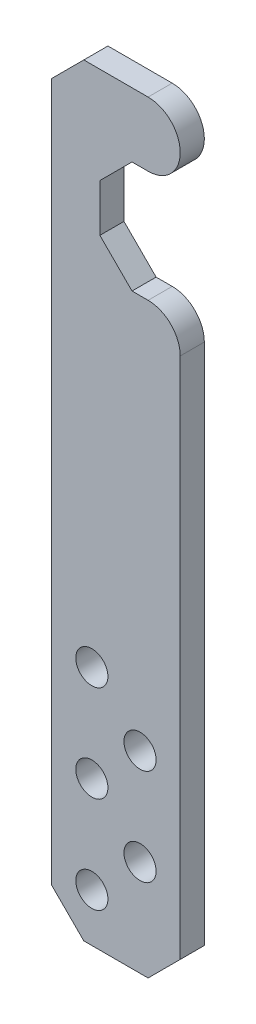
ISO-10303-21;
HEADER;
FILE_DESCRIPTION(('STEP AP214'),'2;1');
FILE_NAME('part.step','',(''),(''),'','','');
FILE_SCHEMA(('AUTOMOTIVE_DESIGN { 1 0 10303 214 1 1 1 1 }'));
ENDSEC;
DATA;
#1=APPLICATION_CONTEXT('core data for automotive mechanical design processes');
#2=APPLICATION_PROTOCOL_DEFINITION('international standard','automotive_design',2000,#1);
#3=PRODUCT_CONTEXT('',#1,'mechanical');
#4=PRODUCT('Part','Part','',(#3));
#5=PRODUCT_RELATED_PRODUCT_CATEGORY('part','',(#4));
#6=PRODUCT_DEFINITION_FORMATION('','',#4);
#7=PRODUCT_DEFINITION_CONTEXT('part definition',#1,'design');
#8=PRODUCT_DEFINITION('design','',#6,#7);
#9=PRODUCT_DEFINITION_SHAPE('','',#8);
#10=(LENGTH_UNIT() NAMED_UNIT(*) SI_UNIT(.MILLI.,.METRE.));
#11=(NAMED_UNIT(*) PLANE_ANGLE_UNIT() SI_UNIT($,.RADIAN.));
#12=(NAMED_UNIT(*) SI_UNIT($,.STERADIAN.) SOLID_ANGLE_UNIT());
#13=UNCERTAINTY_MEASURE_WITH_UNIT(LENGTH_MEASURE(1.E-05),#10,'distance_accuracy_value','');
#14=(GEOMETRIC_REPRESENTATION_CONTEXT(3) GLOBAL_UNCERTAINTY_ASSIGNED_CONTEXT((#13)) GLOBAL_UNIT_ASSIGNED_CONTEXT((#10,
#11,#12)) REPRESENTATION_CONTEXT('',''));
#15=CARTESIAN_POINT('',(0.,0.,0.));
#16=DIRECTION('',(0.,0.,1.));
#17=DIRECTION('',(1.,0.,0.));
#18=AXIS2_PLACEMENT_3D('',#15,#16,#17);
#19=CARTESIAN_POINT('',(-4.00000000000001,-52.5227744249483,1.5));
#20=DIRECTION('',(1.,0.,0.));
#21=DIRECTION('',(0.,1.,0.));
#22=AXIS2_PLACEMENT_3D('',#19,#20,#21);
#23=PLANE('',#22);
#24=DIRECTION('',(0.,-1.,0.));
#25=VECTOR('',#24,1.);
#26=CARTESIAN_POINT('',(-4.00000000000001,-52.5227744249483,0.));
#27=LINE('',#26,#25);
#28=CARTESIAN_POINT('',(-4.00000000000001,-54.5227744249483,0.));
#29=VERTEX_POINT('',#28);
#30=CARTESIAN_POINT('',(-4.,-98.,0.));
#31=VERTEX_POINT('',#30);
#32=EDGE_CURVE('E175',#29,#31,#27,.T.);
#33=ORIENTED_EDGE('',*,*,#32,.T.);
#34=DIRECTION('',(0.,0.,1.));
#35=VECTOR('',#34,1.);
#36=CARTESIAN_POINT('',(-4.,-98.,1.5));
#37=LINE('',#36,#35);
#38=CARTESIAN_POINT('',(-4.,-98.,1.5));
#39=VERTEX_POINT('',#38);
#40=EDGE_CURVE('E232',#31,#39,#37,.T.);
#41=ORIENTED_EDGE('',*,*,#40,.T.);
#42=DIRECTION('',(0.,-1.,0.));
#43=VECTOR('',#42,1.);
#44=CARTESIAN_POINT('',(-4.00000000000001,-52.5227744249483,1.5));
#45=LINE('',#44,#43);
#46=CARTESIAN_POINT('',(-4.00000000000001,-54.5227744249483,1.5));
#47=VERTEX_POINT('',#46);
#48=EDGE_CURVE('E197',#47,#39,#45,.T.);
#49=ORIENTED_EDGE('',*,*,#48,.F.);
#50=DIRECTION('',(0.,0.,-1.));
#51=VECTOR('',#50,1.);
#52=CARTESIAN_POINT('',(-4.00000000000001,-54.5227744249483,1.5));
#53=LINE('',#52,#51);
#54=EDGE_CURVE('E229',#47,#29,#53,.T.);
#55=ORIENTED_EDGE('',*,*,#54,.T.);
#56=EDGE_LOOP('',(#33,#41,#49,#55));
#57=FACE_BOUND('',#56,.T.);
#58=ADVANCED_FACE('F32',(#57),#23,.F.);
#59=CARTESIAN_POINT('',(-4.,-100.,1.5));
#60=DIRECTION('',(0.,1.,0.));
#61=DIRECTION('',(0.,0.,1.));
#62=AXIS2_PLACEMENT_3D('',#59,#60,#61);
#63=PLANE('',#62);
#64=DIRECTION('',(1.,0.,0.));
#65=VECTOR('',#64,1.);
#66=CARTESIAN_POINT('',(-4.,-100.,1.5));
#67=LINE('',#66,#65);
#68=CARTESIAN_POINT('',(-2.00000000000001,-100.,1.5));
#69=VERTEX_POINT('',#68);
#70=CARTESIAN_POINT('',(2.,-100.,1.5));
#71=VERTEX_POINT('',#70);
#72=EDGE_CURVE('E146',#69,#71,#67,.T.);
#73=ORIENTED_EDGE('',*,*,#72,.F.);
#74=DIRECTION('',(0.,0.,-1.));
#75=VECTOR('',#74,1.);
#76=CARTESIAN_POINT('',(-2.00000000000001,-100.,1.5));
#77=LINE('',#76,#75);
#78=CARTESIAN_POINT('',(-2.00000000000001,-100.,0.));
#79=VERTEX_POINT('',#78);
#80=EDGE_CURVE('E220',#69,#79,#77,.T.);
#81=ORIENTED_EDGE('',*,*,#80,.T.);
#82=DIRECTION('',(1.,0.,0.));
#83=VECTOR('',#82,1.);
#84=CARTESIAN_POINT('',(-4.,-100.,0.));
#85=LINE('',#84,#83);
#86=CARTESIAN_POINT('',(2.,-100.,0.));
#87=VERTEX_POINT('',#86);
#88=EDGE_CURVE('E178',#79,#87,#85,.T.);
#89=ORIENTED_EDGE('',*,*,#88,.T.);
#90=DIRECTION('',(0.,0.,1.));
#91=VECTOR('',#90,1.);
#92=CARTESIAN_POINT('',(2.,-100.,1.5));
#93=LINE('',#92,#91);
#94=EDGE_CURVE('E155',#87,#71,#93,.T.);
#95=ORIENTED_EDGE('',*,*,#94,.T.);
#96=EDGE_LOOP('',(#73,#81,#89,#95));
#97=FACE_BOUND('',#96,.T.);
#98=ADVANCED_FACE('F290',(#97),#63,.F.);
#99=CARTESIAN_POINT('',(4.,-65.4772255750517,1.5));
#100=DIRECTION('',(-1.,0.,0.));
#101=DIRECTION('',(0.,-1.,0.));
#102=AXIS2_PLACEMENT_3D('',#99,#100,#101);
#103=PLANE('',#102);
#104=DIRECTION('',(0.,1.,0.));
#105=VECTOR('',#104,1.);
#106=CARTESIAN_POINT('',(4.,-65.4772255750517,1.5));
#107=LINE('',#106,#105);
#108=CARTESIAN_POINT('',(4.,-98.,1.5));
#109=VERTEX_POINT('',#108);
#110=CARTESIAN_POINT('',(4.,-65.4772255750517,1.5));
#111=VERTEX_POINT('',#110);
#112=EDGE_CURVE('E132',#109,#111,#107,.T.);
#113=ORIENTED_EDGE('',*,*,#112,.F.);
#114=DIRECTION('',(0.,0.,-1.));
#115=VECTOR('',#114,1.);
#116=CARTESIAN_POINT('',(4.,-98.,1.5));
#117=LINE('',#116,#115);
#118=CARTESIAN_POINT('',(4.,-98.,0.));
#119=VERTEX_POINT('',#118);
#120=EDGE_CURVE('E239',#109,#119,#117,.T.);
#121=ORIENTED_EDGE('',*,*,#120,.T.);
#122=DIRECTION('',(0.,1.,0.));
#123=VECTOR('',#122,1.);
#124=CARTESIAN_POINT('',(4.,-65.4772255750517,0.));
#125=LINE('',#124,#123);
#126=CARTESIAN_POINT('',(4.,-65.4772255750517,0.));
#127=VERTEX_POINT('',#126);
#128=EDGE_CURVE('E152',#119,#127,#125,.T.);
#129=ORIENTED_EDGE('',*,*,#128,.T.);
#130=DIRECTION('',(0.,0.,-1.));
#131=VECTOR('',#130,1.);
#132=CARTESIAN_POINT('',(4.,-65.4772255750517,1.5));
#133=LINE('',#132,#131);
#134=EDGE_CURVE('E149',#111,#127,#133,.T.);
#135=ORIENTED_EDGE('',*,*,#134,.F.);
#136=EDGE_LOOP('',(#113,#121,#129,#135));
#137=FACE_BOUND('',#136,.T.);
#138=ADVANCED_FACE('F150',(#137),#103,.F.);
#139=CARTESIAN_POINT('',(2.,-65.4772255750517,1.5));
#140=DIRECTION('',(0.,0.,-1.));
#141=DIRECTION('',(-1.,0.,0.));
#142=AXIS2_PLACEMENT_3D('',#139,#140,#141);
#143=CYLINDRICAL_SURFACE('',#142,2.);
#144=CARTESIAN_POINT('',(2.,-65.4772255750517,0.));
#145=DIRECTION('',(0.,0.,1.));
#146=DIRECTION('',(1.,0.,0.));
#147=AXIS2_PLACEMENT_3D('',#144,#145,#146);
#148=CIRCLE('',#147,2.);
#149=CARTESIAN_POINT('',(2.,-63.4772255750517,0.));
#150=VERTEX_POINT('',#149);
#151=EDGE_CURVE('E183',#127,#150,#148,.T.);
#152=ORIENTED_EDGE('',*,*,#151,.T.);
#153=DIRECTION('',(0.,0.,-1.));
#154=VECTOR('',#153,1.);
#155=CARTESIAN_POINT('',(2.,-63.4772255750517,1.5));
#156=LINE('',#155,#154);
#157=CARTESIAN_POINT('',(2.,-63.4772255750517,1.5));
#158=VERTEX_POINT('',#157);
#159=EDGE_CURVE('E156',#158,#150,#156,.T.);
#160=ORIENTED_EDGE('',*,*,#159,.F.);
#161=CARTESIAN_POINT('',(2.,-65.4772255750517,1.5));
#162=DIRECTION('',(0.,0.,1.));
#163=DIRECTION('',(1.,0.,0.));
#164=AXIS2_PLACEMENT_3D('',#161,#162,#163);
#165=CIRCLE('',#164,2.);
#166=EDGE_CURVE('E138',#111,#158,#165,.T.);
#167=ORIENTED_EDGE('',*,*,#166,.F.);
#168=ORIENTED_EDGE('',*,*,#134,.T.);
#169=EDGE_LOOP('',(#152,#160,#167,#168));
#170=FACE_BOUND('',#169,.T.);
#171=ADVANCED_FACE('F158',(#170),#143,.T.);
#172=CARTESIAN_POINT('',(-1.,-63.4772255750517,1.5));
#173=DIRECTION('',(0.,-1.,0.));
#174=DIRECTION('',(0.,0.,-1.));
#175=AXIS2_PLACEMENT_3D('',#172,#173,#174);
#176=PLANE('',#175);
#177=DIRECTION('',(-1.,0.,0.));
#178=VECTOR('',#177,1.);
#179=CARTESIAN_POINT('',(-1.,-63.4772255750517,0.));
#180=LINE('',#179,#178);
#181=CARTESIAN_POINT('',(0.99999999999998,-63.4772255750517,0.));
#182=VERTEX_POINT('',#181);
#183=EDGE_CURVE('E185',#150,#182,#180,.T.);
#184=ORIENTED_EDGE('',*,*,#183,.T.);
#185=DIRECTION('',(0.,0.,1.));
#186=VECTOR('',#185,1.);
#187=CARTESIAN_POINT('',(0.99999999999998,-63.4772255750517,1.5));
#188=LINE('',#187,#186);
#189=CARTESIAN_POINT('',(0.99999999999998,-63.4772255750517,1.5));
#190=VERTEX_POINT('',#189);
#191=EDGE_CURVE('E246',#182,#190,#188,.T.);
#192=ORIENTED_EDGE('',*,*,#191,.T.);
#193=DIRECTION('',(-1.,0.,0.));
#194=VECTOR('',#193,1.);
#195=CARTESIAN_POINT('',(-1.,-63.4772255750517,1.5));
#196=LINE('',#195,#194);
#197=EDGE_CURVE('E161',#158,#190,#196,.T.);
#198=ORIENTED_EDGE('',*,*,#197,.F.);
#199=ORIENTED_EDGE('',*,*,#159,.T.);
#200=EDGE_LOOP('',(#184,#192,#198,#199));
#201=FACE_BOUND('',#200,.T.);
#202=ADVANCED_FACE('F461',(#201),#176,.F.);
#203=CARTESIAN_POINT('',(-1.,-56.5227744249483,1.5));
#204=DIRECTION('',(-1.,0.,0.));
#205=DIRECTION('',(0.,0.,1.));
#206=AXIS2_PLACEMENT_3D('',#203,#204,#205);
#207=PLANE('',#206);
#208=DIRECTION('',(0.,1.,0.));
#209=VECTOR('',#208,1.);
#210=CARTESIAN_POINT('',(-1.,-56.5227744249483,1.5));
#211=LINE('',#210,#209);
#212=CARTESIAN_POINT('',(-1.,-61.4772255750516,1.5));
#213=VERTEX_POINT('',#212);
#214=CARTESIAN_POINT('',(-1.,-58.5227744249483,1.5));
#215=VERTEX_POINT('',#214);
#216=EDGE_CURVE('E163',#213,#215,#211,.T.);
#217=ORIENTED_EDGE('',*,*,#216,.F.);
#218=DIRECTION('',(0.,0.,-1.));
#219=VECTOR('',#218,1.);
#220=CARTESIAN_POINT('',(-1.,-61.4772255750516,0.));
#221=LINE('',#220,#219);
#222=CARTESIAN_POINT('',(-1.,-61.4772255750516,0.));
#223=VERTEX_POINT('',#222);
#224=EDGE_CURVE('E243',#213,#223,#221,.T.);
#225=ORIENTED_EDGE('',*,*,#224,.T.);
#226=DIRECTION('',(0.,1.,0.));
#227=VECTOR('',#226,1.);
#228=CARTESIAN_POINT('',(-1.,-56.5227744249483,0.));
#229=LINE('',#228,#227);
#230=CARTESIAN_POINT('',(-1.,-58.5227744249483,0.));
#231=VERTEX_POINT('',#230);
#232=EDGE_CURVE('E188',#223,#231,#229,.T.);
#233=ORIENTED_EDGE('',*,*,#232,.T.);
#234=DIRECTION('',(0.,0.,1.));
#235=VECTOR('',#234,1.);
#236=CARTESIAN_POINT('',(-1.,-58.5227744249483,1.5));
#237=LINE('',#236,#235);
#238=EDGE_CURVE('E241',#231,#215,#237,.T.);
#239=ORIENTED_EDGE('',*,*,#238,.T.);
#240=EDGE_LOOP('',(#217,#225,#233,#239));
#241=FACE_BOUND('',#240,.T.);
#242=ADVANCED_FACE('F266',(#241),#207,.F.);
#243=CARTESIAN_POINT('',(2.,-56.5227744249483,1.5));
#244=DIRECTION('',(0.,1.,0.));
#245=DIRECTION('',(0.,0.,1.));
#246=AXIS2_PLACEMENT_3D('',#243,#244,#245);
#247=PLANE('',#246);
#248=DIRECTION('',(1.,0.,0.));
#249=VECTOR('',#248,1.);
#250=CARTESIAN_POINT('',(2.,-56.5227744249483,1.5));
#251=LINE('',#250,#249);
#252=CARTESIAN_POINT('',(1.00000000000002,-56.5227744249483,1.5));
#253=VERTEX_POINT('',#252);
#254=CARTESIAN_POINT('',(2.,-56.5227744249483,1.5));
#255=VERTEX_POINT('',#254);
#256=EDGE_CURVE('E168',#253,#255,#251,.T.);
#257=ORIENTED_EDGE('',*,*,#256,.F.);
#258=DIRECTION('',(0.,0.,-1.));
#259=VECTOR('',#258,1.);
#260=CARTESIAN_POINT('',(1.00000000000002,-56.5227744249483,0.));
#261=LINE('',#260,#259);
#262=CARTESIAN_POINT('',(1.00000000000002,-56.5227744249483,0.));
#263=VERTEX_POINT('',#262);
#264=EDGE_CURVE('E248',#253,#263,#261,.T.);
#265=ORIENTED_EDGE('',*,*,#264,.T.);
#266=DIRECTION('',(1.,0.,0.));
#267=VECTOR('',#266,1.);
#268=CARTESIAN_POINT('',(2.,-56.5227744249483,0.));
#269=LINE('',#268,#267);
#270=CARTESIAN_POINT('',(2.,-56.5227744249483,0.));
#271=VERTEX_POINT('',#270);
#272=EDGE_CURVE('E191',#263,#271,#269,.T.);
#273=ORIENTED_EDGE('',*,*,#272,.T.);
#274=DIRECTION('',(0.,0.,-1.));
#275=VECTOR('',#274,1.);
#276=CARTESIAN_POINT('',(2.,-56.5227744249483,1.5));
#277=LINE('',#276,#275);
#278=EDGE_CURVE('E200',#255,#271,#277,.T.);
#279=ORIENTED_EDGE('',*,*,#278,.F.);
#280=EDGE_LOOP('',(#257,#265,#273,#279));
#281=FACE_BOUND('',#280,.T.);
#282=ADVANCED_FACE('F270',(#281),#247,.F.);
#283=CARTESIAN_POINT('',(2.,-54.5227744249483,1.5));
#284=DIRECTION('',(0.,0.,-1.));
#285=DIRECTION('',(-1.,0.,0.));
#286=AXIS2_PLACEMENT_3D('',#283,#284,#285);
#287=CYLINDRICAL_SURFACE('',#286,2.);
#288=CARTESIAN_POINT('',(2.,-54.5227744249483,0.));
#289=DIRECTION('',(0.,0.,1.));
#290=DIRECTION('',(1.,0.,0.));
#291=AXIS2_PLACEMENT_3D('',#288,#289,#290);
#292=CIRCLE('',#291,2.);
#293=CARTESIAN_POINT('',(2.,-52.5227744249483,0.));
#294=VERTEX_POINT('',#293);
#295=EDGE_CURVE('E193',#271,#294,#292,.T.);
#296=ORIENTED_EDGE('',*,*,#295,.T.);
#297=DIRECTION('',(0.,0.,-1.));
#298=VECTOR('',#297,1.);
#299=CARTESIAN_POINT('',(2.,-52.5227744249483,1.5));
#300=LINE('',#299,#298);
#301=CARTESIAN_POINT('',(2.,-52.5227744249483,1.5));
#302=VERTEX_POINT('',#301);
#303=EDGE_CURVE('E174',#302,#294,#300,.T.);
#304=ORIENTED_EDGE('',*,*,#303,.F.);
#305=CARTESIAN_POINT('',(2.,-54.5227744249483,1.5));
#306=DIRECTION('',(0.,0.,1.));
#307=DIRECTION('',(1.,0.,0.));
#308=AXIS2_PLACEMENT_3D('',#305,#306,#307);
#309=CIRCLE('',#308,2.);
#310=EDGE_CURVE('E170',#255,#302,#309,.T.);
#311=ORIENTED_EDGE('',*,*,#310,.F.);
#312=ORIENTED_EDGE('',*,*,#278,.T.);
#313=EDGE_LOOP('',(#296,#304,#311,#312));
#314=FACE_BOUND('',#313,.T.);
#315=ADVANCED_FACE('F276',(#314),#287,.T.);
#316=CARTESIAN_POINT('',(2.,-52.5227744249483,1.5));
#317=DIRECTION('',(0.,-1.,0.));
#318=DIRECTION('',(0.,0.,-1.));
#319=AXIS2_PLACEMENT_3D('',#316,#317,#318);
#320=PLANE('',#319);
#321=DIRECTION('',(-1.,0.,0.));
#322=VECTOR('',#321,1.);
#323=CARTESIAN_POINT('',(2.,-52.5227744249483,0.));
#324=LINE('',#323,#322);
#325=CARTESIAN_POINT('',(-2.,-52.5227744249483,0.));
#326=VERTEX_POINT('',#325);
#327=EDGE_CURVE('E195',#294,#326,#324,.T.);
#328=ORIENTED_EDGE('',*,*,#327,.T.);
#329=DIRECTION('',(0.,0.,1.));
#330=VECTOR('',#329,1.);
#331=CARTESIAN_POINT('',(-2.,-52.5227744249483,1.5));
#332=LINE('',#331,#330);
#333=CARTESIAN_POINT('',(-2.,-52.5227744249483,1.5));
#334=VERTEX_POINT('',#333);
#335=EDGE_CURVE('E47',#326,#334,#332,.T.);
#336=ORIENTED_EDGE('',*,*,#335,.T.);
#337=DIRECTION('',(-1.,0.,0.));
#338=VECTOR('',#337,1.);
#339=CARTESIAN_POINT('',(2.,-52.5227744249483,1.5));
#340=LINE('',#339,#338);
#341=EDGE_CURVE('E172',#302,#334,#340,.T.);
#342=ORIENTED_EDGE('',*,*,#341,.F.);
#343=ORIENTED_EDGE('',*,*,#303,.T.);
#344=EDGE_LOOP('',(#328,#336,#342,#343));
#345=FACE_BOUND('',#344,.T.);
#346=ADVANCED_FACE('F278',(#345),#320,.F.);
#347=CARTESIAN_POINT('',(2.,-65.4772255750517,1.5));
#348=DIRECTION('',(0.,0.,1.));
#349=DIRECTION('',(1.,0.,0.));
#350=AXIS2_PLACEMENT_3D('',#347,#348,#349);
#351=PLANE('',#350);
#352=CARTESIAN_POINT('',(-1.50000000000001,-97.,1.5));
#353=DIRECTION('',(0.,0.,1.));
#354=DIRECTION('',(1.,0.,0.));
#355=AXIS2_PLACEMENT_3D('',#352,#353,#354);
#356=CIRCLE('',#355,1.);
#357=CARTESIAN_POINT('',(-0.50000000000001,-97.,1.5));
#358=VERTEX_POINT('',#357);
#359=EDGE_CURVE('E208',#358,#358,#356,.T.);
#360=ORIENTED_EDGE('',*,*,#359,.F.);
#361=EDGE_LOOP('',(#360));
#362=FACE_BOUND('',#361,.T.);
#363=CARTESIAN_POINT('',(1.49999999999994,-94.,1.5));
#364=DIRECTION('',(0.,0.,1.));
#365=DIRECTION('',(1.,0.,0.));
#366=AXIS2_PLACEMENT_3D('',#363,#364,#365);
#367=CIRCLE('',#366,1.);
#368=CARTESIAN_POINT('',(2.49999999999994,-94.,1.5));
#369=VERTEX_POINT('',#368);
#370=EDGE_CURVE('E335',#369,#369,#367,.T.);
#371=ORIENTED_EDGE('',*,*,#370,.F.);
#372=EDGE_LOOP('',(#371));
#373=FACE_BOUND('',#372,.T.);
#374=CARTESIAN_POINT('',(-1.50000000000001,-91.,1.5));
#375=DIRECTION('',(0.,0.,1.));
#376=DIRECTION('',(1.,0.,0.));
#377=AXIS2_PLACEMENT_3D('',#374,#375,#376);
#378=CIRCLE('',#377,1.);
#379=CARTESIAN_POINT('',(-0.50000000000001,-91.,1.5));
#380=VERTEX_POINT('',#379);
#381=EDGE_CURVE('E332',#380,#380,#378,.T.);
#382=ORIENTED_EDGE('',*,*,#381,.F.);
#383=EDGE_LOOP('',(#382));
#384=FACE_BOUND('',#383,.T.);
#385=CARTESIAN_POINT('',(-1.50000000000001,-85.,1.5));
#386=DIRECTION('',(0.,0.,1.));
#387=DIRECTION('',(1.,0.,0.));
#388=AXIS2_PLACEMENT_3D('',#385,#386,#387);
#389=CIRCLE('',#388,1.);
#390=CARTESIAN_POINT('',(-0.50000000000001,-85.,1.5));
#391=VERTEX_POINT('',#390);
#392=EDGE_CURVE('E329',#391,#391,#389,.T.);
#393=ORIENTED_EDGE('',*,*,#392,.F.);
#394=EDGE_LOOP('',(#393));
#395=FACE_BOUND('',#394,.T.);
#396=CARTESIAN_POINT('',(1.49999999999994,-88.,1.5));
#397=DIRECTION('',(0.,0.,1.));
#398=DIRECTION('',(1.,0.,0.));
#399=AXIS2_PLACEMENT_3D('',#396,#397,#398);
#400=CIRCLE('',#399,1.);
#401=CARTESIAN_POINT('',(2.49999999999994,-88.,1.5));
#402=VERTEX_POINT('',#401);
#403=EDGE_CURVE('E326',#402,#402,#400,.T.);
#404=ORIENTED_EDGE('',*,*,#403,.F.);
#405=EDGE_LOOP('',(#404));
#406=FACE_BOUND('',#405,.T.);
#407=ORIENTED_EDGE('',*,*,#48,.T.);
#408=DIRECTION('',(-0.707106781186546,0.707106781186549,0.));
#409=VECTOR('',#408,1.);
#410=CARTESIAN_POINT('',(-17.2613872124742,-84.7386127875258,1.5));
#411=LINE('',#410,#409);
#412=EDGE_CURVE('E237',#39,#69,#411,.F.);
#413=ORIENTED_EDGE('',*,*,#412,.T.);
#414=ORIENTED_EDGE('',*,*,#72,.T.);
#415=DIRECTION('',(-0.707106781186552,-0.707106781186543,0.));
#416=VECTOR('',#415,1.);
#417=CARTESIAN_POINT('',(19.2613872124742,-82.7386127875261,1.5));
#418=LINE('',#417,#416);
#419=EDGE_CURVE('E142',#71,#109,#418,.F.);
#420=ORIENTED_EDGE('',*,*,#419,.T.);
#421=ORIENTED_EDGE('',*,*,#112,.T.);
#422=ORIENTED_EDGE('',*,*,#166,.T.);
#423=ORIENTED_EDGE('',*,*,#197,.T.);
#424=DIRECTION('',(0.70710678118654,-0.707106781186555,0.));
#425=VECTOR('',#424,1.);
#426=CARTESIAN_POINT('',(-1.,-61.4772255750516,1.5));
#427=LINE('',#426,#425);
#428=EDGE_CURVE('E254',#190,#213,#427,.F.);
#429=ORIENTED_EDGE('',*,*,#428,.T.);
#430=ORIENTED_EDGE('',*,*,#216,.T.);
#431=DIRECTION('',(-0.707106781186551,-0.707106781186544,0.));
#432=VECTOR('',#431,1.);
#433=CARTESIAN_POINT('',(1.00000000000002,-56.5227744249483,1.5));
#434=LINE('',#433,#432);
#435=EDGE_CURVE('E11',#215,#253,#434,.F.);
#436=ORIENTED_EDGE('',*,*,#435,.T.);
#437=ORIENTED_EDGE('',*,*,#256,.T.);
#438=ORIENTED_EDGE('',*,*,#310,.T.);
#439=ORIENTED_EDGE('',*,*,#341,.T.);
#440=DIRECTION('',(0.707106781186549,0.707106781186546,0.));
#441=VECTOR('',#440,1.);
#442=CARTESIAN_POINT('',(-6.47722557505165,-57.,1.5));
#443=LINE('',#442,#441);
#444=EDGE_CURVE('E234',#334,#47,#443,.F.);
#445=ORIENTED_EDGE('',*,*,#444,.T.);
#446=EDGE_LOOP('',(#407,#413,#414,#420,#421,#422,#423,#429,#430,#436,#437,#438,#439,#445));
#447=FACE_BOUND('',#446,.T.);
#448=ADVANCED_FACE('F135',(#362,#373,#384,#395,#406,#447),#351,.T.);
#449=CARTESIAN_POINT('',(2.,-65.4772255750517,0.));
#450=DIRECTION('',(0.,0.,1.));
#451=DIRECTION('',(1.,0.,0.));
#452=AXIS2_PLACEMENT_3D('',#449,#450,#451);
#453=PLANE('',#452);
#454=CARTESIAN_POINT('',(-1.50000000000001,-97.,0.));
#455=DIRECTION('',(0.,0.,1.));
#456=DIRECTION('',(1.,0.,0.));
#457=AXIS2_PLACEMENT_3D('',#454,#455,#456);
#458=CIRCLE('',#457,1.);
#459=CARTESIAN_POINT('',(-0.50000000000001,-97.,0.));
#460=VERTEX_POINT('',#459);
#461=EDGE_CURVE('E179',#460,#460,#458,.T.);
#462=ORIENTED_EDGE('',*,*,#461,.T.);
#463=EDGE_LOOP('',(#462));
#464=FACE_BOUND('',#463,.T.);
#465=CARTESIAN_POINT('',(1.49999999999994,-94.,0.));
#466=DIRECTION('',(0.,0.,1.));
#467=DIRECTION('',(1.,0.,0.));
#468=AXIS2_PLACEMENT_3D('',#465,#466,#467);
#469=CIRCLE('',#468,1.);
#470=CARTESIAN_POINT('',(2.49999999999994,-94.,0.));
#471=VERTEX_POINT('',#470);
#472=EDGE_CURVE('E214',#471,#471,#469,.T.);
#473=ORIENTED_EDGE('',*,*,#472,.T.);
#474=EDGE_LOOP('',(#473));
#475=FACE_BOUND('',#474,.T.);
#476=CARTESIAN_POINT('',(-1.50000000000001,-91.,0.));
#477=DIRECTION('',(0.,0.,1.));
#478=DIRECTION('',(1.,0.,0.));
#479=AXIS2_PLACEMENT_3D('',#476,#477,#478);
#480=CIRCLE('',#479,1.);
#481=CARTESIAN_POINT('',(-0.50000000000001,-91.,0.));
#482=VERTEX_POINT('',#481);
#483=EDGE_CURVE('E211',#482,#482,#480,.T.);
#484=ORIENTED_EDGE('',*,*,#483,.T.);
#485=EDGE_LOOP('',(#484));
#486=FACE_BOUND('',#485,.T.);
#487=CARTESIAN_POINT('',(-1.50000000000001,-85.,0.));
#488=DIRECTION('',(0.,0.,1.));
#489=DIRECTION('',(1.,0.,0.));
#490=AXIS2_PLACEMENT_3D('',#487,#488,#489);
#491=CIRCLE('',#490,1.);
#492=CARTESIAN_POINT('',(-0.50000000000001,-85.,0.));
#493=VERTEX_POINT('',#492);
#494=EDGE_CURVE('E207',#493,#493,#491,.T.);
#495=ORIENTED_EDGE('',*,*,#494,.T.);
#496=EDGE_LOOP('',(#495));
#497=FACE_BOUND('',#496,.T.);
#498=CARTESIAN_POINT('',(1.49999999999994,-88.,0.));
#499=DIRECTION('',(0.,0.,1.));
#500=DIRECTION('',(1.,0.,0.));
#501=AXIS2_PLACEMENT_3D('',#498,#499,#500);
#502=CIRCLE('',#501,1.);
#503=CARTESIAN_POINT('',(2.49999999999994,-88.,0.));
#504=VERTEX_POINT('',#503);
#505=EDGE_CURVE('E204',#504,#504,#502,.T.);
#506=ORIENTED_EDGE('',*,*,#505,.T.);
#507=EDGE_LOOP('',(#506));
#508=FACE_BOUND('',#507,.T.);
#509=ORIENTED_EDGE('',*,*,#88,.F.);
#510=DIRECTION('',(0.707106781186546,-0.707106781186549,0.));
#511=VECTOR('',#510,1.);
#512=CARTESIAN_POINT('',(-2.00000000000001,-100.,0.));
#513=LINE('',#512,#511);
#514=EDGE_CURVE('E227',#79,#31,#513,.F.);
#515=ORIENTED_EDGE('',*,*,#514,.T.);
#516=ORIENTED_EDGE('',*,*,#32,.F.);
#517=DIRECTION('',(-0.707106781186549,-0.707106781186546,0.));
#518=VECTOR('',#517,1.);
#519=CARTESIAN_POINT('',(-4.00000000000001,-54.5227744249483,0.));
#520=LINE('',#519,#518);
#521=EDGE_CURVE('E223',#29,#326,#520,.F.);
#522=ORIENTED_EDGE('',*,*,#521,.T.);
#523=ORIENTED_EDGE('',*,*,#327,.F.);
#524=ORIENTED_EDGE('',*,*,#295,.F.);
#525=ORIENTED_EDGE('',*,*,#272,.F.);
#526=DIRECTION('',(0.707106781186551,0.707106781186544,0.));
#527=VECTOR('',#526,1.);
#528=CARTESIAN_POINT('',(-2.97722557505164,-60.5,0.));
#529=LINE('',#528,#527);
#530=EDGE_CURVE('E40',#263,#231,#529,.F.);
#531=ORIENTED_EDGE('',*,*,#530,.T.);
#532=ORIENTED_EDGE('',*,*,#232,.F.);
#533=DIRECTION('',(-0.70710678118654,0.707106781186555,0.));
#534=VECTOR('',#533,1.);
#535=CARTESIAN_POINT('',(2.49999999999998,-64.9772255750517,0.));
#536=LINE('',#535,#534);
#537=EDGE_CURVE('E252',#223,#182,#536,.F.);
#538=ORIENTED_EDGE('',*,*,#537,.T.);
#539=ORIENTED_EDGE('',*,*,#183,.F.);
#540=ORIENTED_EDGE('',*,*,#151,.F.);
#541=ORIENTED_EDGE('',*,*,#128,.F.);
#542=DIRECTION('',(0.707106781186552,0.707106781186543,0.));
#543=VECTOR('',#542,1.);
#544=CARTESIAN_POINT('',(4.,-98.,0.));
#545=LINE('',#544,#543);
#546=EDGE_CURVE('E225',#119,#87,#545,.F.);
#547=ORIENTED_EDGE('',*,*,#546,.T.);
#548=EDGE_LOOP('',(#509,#515,#516,#522,#523,#524,#525,#531,#532,#538,#539,#540,#541,#547));
#549=FACE_BOUND('',#548,.T.);
#550=ADVANCED_FACE('F259',(#464,#475,#486,#497,#508,#549),#453,.F.);
#551=CARTESIAN_POINT('',(1.49999999999994,-88.,-3.5));
#552=DIRECTION('',(0.,0.,1.));
#553=DIRECTION('',(1.,0.,0.));
#554=AXIS2_PLACEMENT_3D('',#551,#552,#553);
#555=CYLINDRICAL_SURFACE('',#554,1.);
#556=ORIENTED_EDGE('',*,*,#403,.T.);
#557=EDGE_LOOP('',(#556));
#558=FACE_BOUND('',#557,.T.);
#559=ORIENTED_EDGE('',*,*,#505,.F.);
#560=EDGE_LOOP('',(#559));
#561=FACE_BOUND('',#560,.T.);
#562=ADVANCED_FACE('F351',(#558,#561),#555,.F.);
#563=CARTESIAN_POINT('',(-1.50000000000001,-85.,-3.5));
#564=DIRECTION('',(0.,0.,1.));
#565=DIRECTION('',(1.,0.,0.));
#566=AXIS2_PLACEMENT_3D('',#563,#564,#565);
#567=CYLINDRICAL_SURFACE('',#566,1.);
#568=ORIENTED_EDGE('',*,*,#392,.T.);
#569=EDGE_LOOP('',(#568));
#570=FACE_BOUND('',#569,.T.);
#571=ORIENTED_EDGE('',*,*,#494,.F.);
#572=EDGE_LOOP('',(#571));
#573=FACE_BOUND('',#572,.T.);
#574=ADVANCED_FACE('F354',(#570,#573),#567,.F.);
#575=CARTESIAN_POINT('',(-1.50000000000001,-91.,-3.5));
#576=DIRECTION('',(0.,0.,1.));
#577=DIRECTION('',(1.,0.,0.));
#578=AXIS2_PLACEMENT_3D('',#575,#576,#577);
#579=CYLINDRICAL_SURFACE('',#578,1.);
#580=ORIENTED_EDGE('',*,*,#381,.T.);
#581=EDGE_LOOP('',(#580));
#582=FACE_BOUND('',#581,.T.);
#583=ORIENTED_EDGE('',*,*,#483,.F.);
#584=EDGE_LOOP('',(#583));
#585=FACE_BOUND('',#584,.T.);
#586=ADVANCED_FACE('F366',(#582,#585),#579,.F.);
#587=CARTESIAN_POINT('',(1.49999999999994,-94.,-3.5));
#588=DIRECTION('',(0.,0.,1.));
#589=DIRECTION('',(1.,0.,0.));
#590=AXIS2_PLACEMENT_3D('',#587,#588,#589);
#591=CYLINDRICAL_SURFACE('',#590,1.);
#592=ORIENTED_EDGE('',*,*,#370,.T.);
#593=EDGE_LOOP('',(#592));
#594=FACE_BOUND('',#593,.T.);
#595=ORIENTED_EDGE('',*,*,#472,.F.);
#596=EDGE_LOOP('',(#595));
#597=FACE_BOUND('',#596,.T.);
#598=ADVANCED_FACE('F370',(#594,#597),#591,.F.);
#599=CARTESIAN_POINT('',(-1.50000000000001,-97.,-3.5));
#600=DIRECTION('',(0.,0.,1.));
#601=DIRECTION('',(1.,0.,0.));
#602=AXIS2_PLACEMENT_3D('',#599,#600,#601);
#603=CYLINDRICAL_SURFACE('',#602,1.);
#604=ORIENTED_EDGE('',*,*,#359,.T.);
#605=EDGE_LOOP('',(#604));
#606=FACE_BOUND('',#605,.T.);
#607=ORIENTED_EDGE('',*,*,#461,.F.);
#608=EDGE_LOOP('',(#607));
#609=FACE_BOUND('',#608,.T.);
#610=ADVANCED_FACE('F304',(#606,#609),#603,.F.);
#611=CARTESIAN_POINT('',(-2.00000000000001,-100.,1.5));
#612=DIRECTION('',(0.707106781186549,0.707106781186546,0.));
#613=DIRECTION('',(0.,0.,-1.));
#614=AXIS2_PLACEMENT_3D('',#611,#612,#613);
#615=PLANE('',#614);
#616=ORIENTED_EDGE('',*,*,#412,.F.);
#617=ORIENTED_EDGE('',*,*,#40,.F.);
#618=ORIENTED_EDGE('',*,*,#514,.F.);
#619=ORIENTED_EDGE('',*,*,#80,.F.);
#620=EDGE_LOOP('',(#616,#617,#618,#619));
#621=FACE_BOUND('',#620,.T.);
#622=ADVANCED_FACE('F300',(#621),#615,.F.);
#623=CARTESIAN_POINT('',(4.,-98.,1.5));
#624=DIRECTION('',(-0.707106781186543,0.707106781186552,0.));
#625=DIRECTION('',(0.,0.,-1.));
#626=AXIS2_PLACEMENT_3D('',#623,#624,#625);
#627=PLANE('',#626);
#628=ORIENTED_EDGE('',*,*,#419,.F.);
#629=ORIENTED_EDGE('',*,*,#94,.F.);
#630=ORIENTED_EDGE('',*,*,#546,.F.);
#631=ORIENTED_EDGE('',*,*,#120,.F.);
#632=EDGE_LOOP('',(#628,#629,#630,#631));
#633=FACE_BOUND('',#632,.T.);
#634=ADVANCED_FACE('F303',(#633),#627,.F.);
#635=CARTESIAN_POINT('',(-1.,-61.4772255750516,1.5));
#636=DIRECTION('',(0.707106781186555,0.70710678118654,0.));
#637=DIRECTION('',(0.,0.,1.));
#638=AXIS2_PLACEMENT_3D('',#635,#636,#637);
#639=PLANE('',#638);
#640=ORIENTED_EDGE('',*,*,#428,.F.);
#641=ORIENTED_EDGE('',*,*,#191,.F.);
#642=ORIENTED_EDGE('',*,*,#537,.F.);
#643=ORIENTED_EDGE('',*,*,#224,.F.);
#644=EDGE_LOOP('',(#640,#641,#642,#643));
#645=FACE_BOUND('',#644,.T.);
#646=ADVANCED_FACE('F308',(#645),#639,.T.);
#647=CARTESIAN_POINT('',(1.00000000000002,-56.5227744249483,1.5));
#648=DIRECTION('',(0.707106781186544,-0.707106781186551,0.));
#649=DIRECTION('',(0.,0.,1.));
#650=AXIS2_PLACEMENT_3D('',#647,#648,#649);
#651=PLANE('',#650);
#652=ORIENTED_EDGE('',*,*,#435,.F.);
#653=ORIENTED_EDGE('',*,*,#238,.F.);
#654=ORIENTED_EDGE('',*,*,#530,.F.);
#655=ORIENTED_EDGE('',*,*,#264,.F.);
#656=EDGE_LOOP('',(#652,#653,#654,#655));
#657=FACE_BOUND('',#656,.T.);
#658=ADVANCED_FACE('F268',(#657),#651,.T.);
#659=CARTESIAN_POINT('',(-4.00000000000001,-54.5227744249483,1.5));
#660=DIRECTION('',(0.707106781186546,-0.707106781186549,0.));
#661=DIRECTION('',(0.,0.,-1.));
#662=AXIS2_PLACEMENT_3D('',#659,#660,#661);
#663=PLANE('',#662);
#664=ORIENTED_EDGE('',*,*,#444,.F.);
#665=ORIENTED_EDGE('',*,*,#335,.F.);
#666=ORIENTED_EDGE('',*,*,#521,.F.);
#667=ORIENTED_EDGE('',*,*,#54,.F.);
#668=EDGE_LOOP('',(#664,#665,#666,#667));
#669=FACE_BOUND('',#668,.T.);
#670=ADVANCED_FACE('F34',(#669),#663,.F.);
#671=CLOSED_SHELL('',(#58,#98,#138,#171,#202,#242,#282,#315,#346,#448,#550,#562,#574,#586,#598,
#610,#622,#634,#646,#658,#670));
#672=MANIFOLD_SOLID_BREP('B2',#671);
#673=ADVANCED_BREP_SHAPE_REPRESENTATION('',(#18,#672),#14);
#674=SHAPE_DEFINITION_REPRESENTATION(#9,#673);
ENDSEC;
END-ISO-10303-21;
